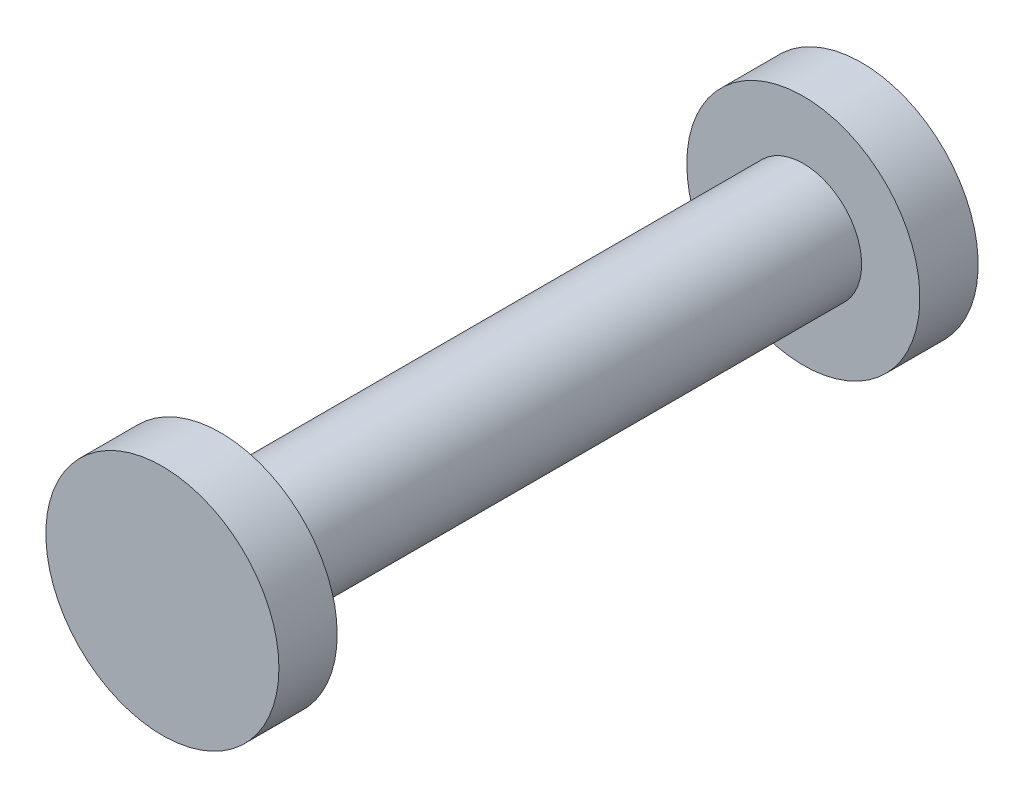
ISO-10303-21;
HEADER;
FILE_DESCRIPTION(('STEP AP214'),'2;1');
FILE_NAME('part.step','',(''),(''),'','','');
FILE_SCHEMA(('AUTOMOTIVE_DESIGN { 1 0 10303 214 1 1 1 1 }'));
ENDSEC;
DATA;
#1=APPLICATION_CONTEXT('core data for automotive mechanical design processes');
#2=APPLICATION_PROTOCOL_DEFINITION('international standard','automotive_design',2000,#1);
#3=PRODUCT_CONTEXT('',#1,'mechanical');
#4=PRODUCT('Part','Part','',(#3));
#5=PRODUCT_RELATED_PRODUCT_CATEGORY('part','',(#4));
#6=PRODUCT_DEFINITION_FORMATION('','',#4);
#7=PRODUCT_DEFINITION_CONTEXT('part definition',#1,'design');
#8=PRODUCT_DEFINITION('design','',#6,#7);
#9=PRODUCT_DEFINITION_SHAPE('','',#8);
#10=(LENGTH_UNIT() NAMED_UNIT(*) SI_UNIT(.MILLI.,.METRE.));
#11=(NAMED_UNIT(*) PLANE_ANGLE_UNIT() SI_UNIT($,.RADIAN.));
#12=(NAMED_UNIT(*) SI_UNIT($,.STERADIAN.) SOLID_ANGLE_UNIT());
#13=UNCERTAINTY_MEASURE_WITH_UNIT(LENGTH_MEASURE(1.E-05),#10,'distance_accuracy_value','');
#14=(GEOMETRIC_REPRESENTATION_CONTEXT(3) GLOBAL_UNCERTAINTY_ASSIGNED_CONTEXT((#13)) GLOBAL_UNIT_ASSIGNED_CONTEXT((#10,
#11,#12)) REPRESENTATION_CONTEXT('',''));
#15=CARTESIAN_POINT('',(0.,0.,0.));
#16=DIRECTION('',(0.,0.,1.));
#17=DIRECTION('',(1.,0.,0.));
#18=AXIS2_PLACEMENT_3D('',#15,#16,#17);
#19=CARTESIAN_POINT('',(0.,0.,50.));
#20=DIRECTION('',(0.,0.,-1.));
#21=DIRECTION('',(-1.,0.,0.));
#22=AXIS2_PLACEMENT_3D('',#19,#20,#21);
#23=CYLINDRICAL_SURFACE('',#22,5.);
#24=CARTESIAN_POINT('',(0.,0.,50.));
#25=DIRECTION('',(0.,0.,1.));
#26=DIRECTION('',(1.,0.,0.));
#27=AXIS2_PLACEMENT_3D('',#24,#25,#26);
#28=CIRCLE('',#27,5.);
#29=CARTESIAN_POINT('',(5.,0.,50.));
#30=VERTEX_POINT('',#29);
#31=EDGE_CURVE('E10',#30,#30,#28,.T.);
#32=ORIENTED_EDGE('',*,*,#31,.F.);
#33=EDGE_LOOP('',(#32));
#34=FACE_BOUND('',#33,.T.);
#35=CARTESIAN_POINT('',(0.,0.,0.));
#36=DIRECTION('',(0.,0.,1.));
#37=DIRECTION('',(1.,0.,0.));
#38=AXIS2_PLACEMENT_3D('',#35,#36,#37);
#39=CIRCLE('',#38,5.);
#40=CARTESIAN_POINT('',(5.,0.,0.));
#41=VERTEX_POINT('',#40);
#42=EDGE_CURVE('E38',#41,#41,#39,.T.);
#43=ORIENTED_EDGE('',*,*,#42,.T.);
#44=EDGE_LOOP('',(#43));
#45=FACE_BOUND('',#44,.T.);
#46=ADVANCED_FACE('F35',(#34,#45),#23,.T.);
#47=CARTESIAN_POINT('',(0.,0.,-5.));
#48=DIRECTION('',(0.,0.,1.));
#49=DIRECTION('',(1.,0.,0.));
#50=AXIS2_PLACEMENT_3D('',#47,#48,#49);
#51=CYLINDRICAL_SURFACE('',#50,10.);
#52=CARTESIAN_POINT('',(0.,0.,-5.));
#53=DIRECTION('',(0.,0.,-1.));
#54=DIRECTION('',(-1.,0.,0.));
#55=AXIS2_PLACEMENT_3D('',#52,#53,#54);
#56=CIRCLE('',#55,10.);
#57=CARTESIAN_POINT('',(-10.,0.,-5.));
#58=VERTEX_POINT('',#57);
#59=EDGE_CURVE('E45',#58,#58,#56,.T.);
#60=ORIENTED_EDGE('',*,*,#59,.F.);
#61=EDGE_LOOP('',(#60));
#62=FACE_BOUND('',#61,.T.);
#63=CARTESIAN_POINT('',(0.,0.,0.));
#64=DIRECTION('',(0.,0.,-1.));
#65=DIRECTION('',(-1.,0.,0.));
#66=AXIS2_PLACEMENT_3D('',#63,#64,#65);
#67=CIRCLE('',#66,10.);
#68=CARTESIAN_POINT('',(-10.,0.,0.));
#69=VERTEX_POINT('',#68);
#70=EDGE_CURVE('E47',#69,#69,#67,.T.);
#71=ORIENTED_EDGE('',*,*,#70,.T.);
#72=EDGE_LOOP('',(#71));
#73=FACE_BOUND('',#72,.T.);
#74=ADVANCED_FACE('F76',(#62,#73),#51,.T.);
#75=CARTESIAN_POINT('',(0.,0.,-5.));
#76=DIRECTION('',(0.,0.,-1.));
#77=DIRECTION('',(-1.,0.,0.));
#78=AXIS2_PLACEMENT_3D('',#75,#76,#77);
#79=PLANE('',#78);
#80=ORIENTED_EDGE('',*,*,#59,.T.);
#81=EDGE_LOOP('',(#80));
#82=FACE_BOUND('',#81,.T.);
#83=ADVANCED_FACE('F81',(#82),#79,.T.);
#84=CARTESIAN_POINT('',(0.,0.,0.));
#85=DIRECTION('',(0.,0.,-1.));
#86=DIRECTION('',(-1.,0.,0.));
#87=AXIS2_PLACEMENT_3D('',#84,#85,#86);
#88=PLANE('',#87);
#89=ORIENTED_EDGE('',*,*,#42,.F.);
#90=EDGE_LOOP('',(#89));
#91=FACE_BOUND('',#90,.T.);
#92=ORIENTED_EDGE('',*,*,#70,.F.);
#93=EDGE_LOOP('',(#92));
#94=FACE_BOUND('',#93,.T.);
#95=ADVANCED_FACE('F64',(#91,#94),#88,.F.);
#96=CARTESIAN_POINT('',(0.,0.,55.));
#97=DIRECTION('',(0.,0.,-1.));
#98=DIRECTION('',(-1.,0.,0.));
#99=AXIS2_PLACEMENT_3D('',#96,#97,#98);
#100=CYLINDRICAL_SURFACE('',#99,10.);
#101=CARTESIAN_POINT('',(0.,0.,55.));
#102=DIRECTION('',(0.,0.,1.));
#103=DIRECTION('',(1.,0.,0.));
#104=AXIS2_PLACEMENT_3D('',#101,#102,#103);
#105=CIRCLE('',#104,10.);
#106=CARTESIAN_POINT('',(10.,0.,55.));
#107=VERTEX_POINT('',#106);
#108=EDGE_CURVE('E50',#107,#107,#105,.T.);
#109=ORIENTED_EDGE('',*,*,#108,.F.);
#110=EDGE_LOOP('',(#109));
#111=FACE_BOUND('',#110,.T.);
#112=CARTESIAN_POINT('',(0.,0.,50.));
#113=DIRECTION('',(0.,0.,1.));
#114=DIRECTION('',(1.,0.,0.));
#115=AXIS2_PLACEMENT_3D('',#112,#113,#114);
#116=CIRCLE('',#115,10.);
#117=CARTESIAN_POINT('',(10.,0.,50.));
#118=VERTEX_POINT('',#117);
#119=EDGE_CURVE('E53',#118,#118,#116,.T.);
#120=ORIENTED_EDGE('',*,*,#119,.T.);
#121=EDGE_LOOP('',(#120));
#122=FACE_BOUND('',#121,.T.);
#123=ADVANCED_FACE('F61',(#111,#122),#100,.T.);
#124=CARTESIAN_POINT('',(0.,0.,55.));
#125=DIRECTION('',(0.,0.,1.));
#126=DIRECTION('',(1.,0.,0.));
#127=AXIS2_PLACEMENT_3D('',#124,#125,#126);
#128=PLANE('',#127);
#129=ORIENTED_EDGE('',*,*,#108,.T.);
#130=EDGE_LOOP('',(#129));
#131=FACE_BOUND('',#130,.T.);
#132=ADVANCED_FACE('F59',(#131),#128,.T.);
#133=CARTESIAN_POINT('',(0.,0.,50.));
#134=DIRECTION('',(0.,0.,1.));
#135=DIRECTION('',(1.,0.,0.));
#136=AXIS2_PLACEMENT_3D('',#133,#134,#135);
#137=PLANE('',#136);
#138=ORIENTED_EDGE('',*,*,#31,.T.);
#139=EDGE_LOOP('',(#138));
#140=FACE_BOUND('',#139,.T.);
#141=ORIENTED_EDGE('',*,*,#119,.F.);
#142=EDGE_LOOP('',(#141));
#143=FACE_BOUND('',#142,.T.);
#144=ADVANCED_FACE('F68',(#140,#143),#137,.F.);
#145=CLOSED_SHELL('',(#46,#74,#83,#95,#123,#132,#144));
#146=MANIFOLD_SOLID_BREP('B2',#145);
#147=ADVANCED_BREP_SHAPE_REPRESENTATION('',(#18,#146),#14);
#148=SHAPE_DEFINITION_REPRESENTATION(#9,#147);
ENDSEC;
END-ISO-10303-21;
